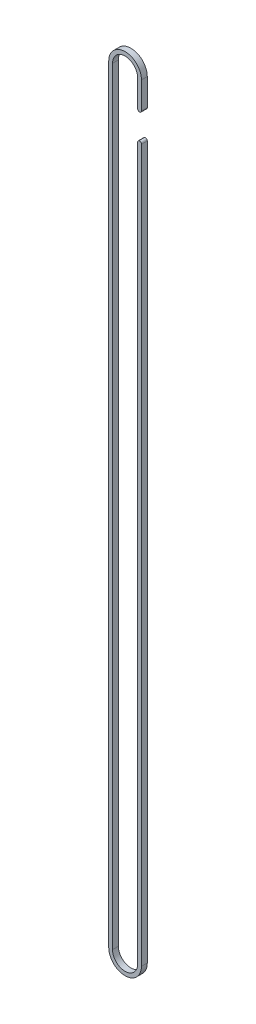
ISO-10303-21;
HEADER;
FILE_DESCRIPTION(('STEP AP214'),'2;1');
FILE_NAME('part.step','',(''),(''),'','','');
FILE_SCHEMA(('AUTOMOTIVE_DESIGN { 1 0 10303 214 1 1 1 1 }'));
ENDSEC;
DATA;
#1=APPLICATION_CONTEXT('core data for automotive mechanical design processes');
#2=APPLICATION_PROTOCOL_DEFINITION('international standard','automotive_design',2000,#1);
#3=PRODUCT_CONTEXT('',#1,'mechanical');
#4=PRODUCT('Part','Part','',(#3));
#5=PRODUCT_RELATED_PRODUCT_CATEGORY('part','',(#4));
#6=PRODUCT_DEFINITION_FORMATION('','',#4);
#7=PRODUCT_DEFINITION_CONTEXT('part definition',#1,'design');
#8=PRODUCT_DEFINITION('design','',#6,#7);
#9=PRODUCT_DEFINITION_SHAPE('','',#8);
#10=(LENGTH_UNIT() NAMED_UNIT(*) SI_UNIT(.MILLI.,.METRE.));
#11=(NAMED_UNIT(*) PLANE_ANGLE_UNIT() SI_UNIT($,.RADIAN.));
#12=(NAMED_UNIT(*) SI_UNIT($,.STERADIAN.) SOLID_ANGLE_UNIT());
#13=UNCERTAINTY_MEASURE_WITH_UNIT(LENGTH_MEASURE(1.E-05),#10,'distance_accuracy_value','');
#14=(GEOMETRIC_REPRESENTATION_CONTEXT(3) GLOBAL_UNCERTAINTY_ASSIGNED_CONTEXT((#13)) GLOBAL_UNIT_ASSIGNED_CONTEXT((#10,
#11,#12)) REPRESENTATION_CONTEXT('',''));
#15=CARTESIAN_POINT('',(0.,0.,0.));
#16=DIRECTION('',(0.,0.,1.));
#17=DIRECTION('',(1.,0.,0.));
#18=AXIS2_PLACEMENT_3D('',#15,#16,#17);
#19=CARTESIAN_POINT('',(22.233945549938,504.825,-4.5));
#20=DIRECTION('',(0.,0.,1.));
#21=DIRECTION('',(1.,0.,0.));
#22=AXIS2_PLACEMENT_3D('',#19,#20,#21);
#23=CYLINDRICAL_SURFACE('',#22,2.9464);
#24=CARTESIAN_POINT('',(22.233945549938,504.825,4.5));
#25=DIRECTION('',(0.,0.,-1.));
#26=DIRECTION('',(-1.,0.,0.));
#27=AXIS2_PLACEMENT_3D('',#24,#25,#26);
#28=CIRCLE('',#27,2.9464);
#29=CARTESIAN_POINT('',(19.287545549938,504.825,4.5));
#30=VERTEX_POINT('',#29);
#31=CARTESIAN_POINT('',(25.180345549938,504.825,4.5));
#32=VERTEX_POINT('',#31);
#33=EDGE_CURVE('E74',#30,#32,#28,.T.);
#34=ORIENTED_EDGE('',*,*,#33,.T.);
#35=DIRECTION('',(0.,0.,1.));
#36=VECTOR('',#35,1.);
#37=CARTESIAN_POINT('',(25.180345549938,504.825,-4.5));
#38=LINE('',#37,#36);
#39=CARTESIAN_POINT('',(25.180345549938,504.825,-4.5));
#40=VERTEX_POINT('',#39);
#41=EDGE_CURVE('E285',#40,#32,#38,.T.);
#42=ORIENTED_EDGE('',*,*,#41,.F.);
#43=CARTESIAN_POINT('',(22.233945549938,504.825,-4.5));
#44=DIRECTION('',(0.,0.,-1.));
#45=DIRECTION('',(-1.,0.,0.));
#46=AXIS2_PLACEMENT_3D('',#43,#44,#45);
#47=CIRCLE('',#46,2.9464);
#48=CARTESIAN_POINT('',(19.2875455499376,504.825,-4.5));
#49=VERTEX_POINT('',#48);
#50=EDGE_CURVE('E60',#49,#40,#47,.T.);
#51=ORIENTED_EDGE('',*,*,#50,.F.);
#52=DIRECTION('',(0.,0.,1.));
#53=VECTOR('',#52,1.);
#54=CARTESIAN_POINT('',(19.287545549938,504.825,-4.5));
#55=LINE('',#54,#53);
#56=EDGE_CURVE('E213',#49,#30,#55,.T.);
#57=ORIENTED_EDGE('',*,*,#56,.T.);
#58=EDGE_LOOP('',(#34,#42,#51,#57));
#59=FACE_BOUND('',#58,.T.);
#60=ADVANCED_FACE('F16',(#59),#23,.T.);
#61=CARTESIAN_POINT('',(22.233945549938,549.275,-4.5));
#62=DIRECTION('',(0.,0.,1.));
#63=DIRECTION('',(1.,0.,0.));
#64=AXIS2_PLACEMENT_3D('',#61,#62,#63);
#65=CYLINDRICAL_SURFACE('',#64,2.9464);
#66=CARTESIAN_POINT('',(22.233945549938,549.275,4.5));
#67=DIRECTION('',(0.,0.,-1.));
#68=DIRECTION('',(1.,0.,0.));
#69=AXIS2_PLACEMENT_3D('',#66,#67,#68);
#70=CIRCLE('',#69,2.9464);
#71=CARTESIAN_POINT('',(25.180345549938,549.275,4.5));
#72=VERTEX_POINT('',#71);
#73=CARTESIAN_POINT('',(19.2875455499376,549.275,4.5));
#74=VERTEX_POINT('',#73);
#75=EDGE_CURVE('E189',#72,#74,#70,.T.);
#76=ORIENTED_EDGE('',*,*,#75,.T.);
#77=DIRECTION('',(0.,0.,1.));
#78=VECTOR('',#77,1.);
#79=CARTESIAN_POINT('',(19.287545549938,549.275,-4.5));
#80=LINE('',#79,#78);
#81=CARTESIAN_POINT('',(19.287545549938,549.275,-4.5));
#82=VERTEX_POINT('',#81);
#83=EDGE_CURVE('E193',#82,#74,#80,.T.);
#84=ORIENTED_EDGE('',*,*,#83,.F.);
#85=CARTESIAN_POINT('',(22.233945549938,549.275,-4.5));
#86=DIRECTION('',(0.,0.,-1.));
#87=DIRECTION('',(1.,0.,0.));
#88=AXIS2_PLACEMENT_3D('',#85,#86,#87);
#89=CIRCLE('',#88,2.9464);
#90=CARTESIAN_POINT('',(25.180345549938,549.275,-4.5));
#91=VERTEX_POINT('',#90);
#92=EDGE_CURVE('E200',#91,#82,#89,.T.);
#93=ORIENTED_EDGE('',*,*,#92,.F.);
#94=DIRECTION('',(0.,0.,1.));
#95=VECTOR('',#94,1.);
#96=CARTESIAN_POINT('',(25.180345549938,549.275,-4.5));
#97=LINE('',#96,#95);
#98=EDGE_CURVE('E261',#91,#72,#97,.T.);
#99=ORIENTED_EDGE('',*,*,#98,.T.);
#100=EDGE_LOOP('',(#76,#84,#93,#99));
#101=FACE_BOUND('',#100,.T.);
#102=ADVANCED_FACE('F18',(#101),#65,.T.);
#103=CARTESIAN_POINT('',(-19.287545549938,-590.55,4.5));
#104=DIRECTION('',(1.,0.,0.));
#105=DIRECTION('',(0.,1.,0.));
#106=AXIS2_PLACEMENT_3D('',#103,#104,#105);
#107=PLANE('',#106);
#108=DIRECTION('',(0.,-1.,0.));
#109=VECTOR('',#108,1.);
#110=CARTESIAN_POINT('',(-19.287545549938,-590.55,-4.5));
#111=LINE('',#110,#109);
#112=CARTESIAN_POINT('',(-19.287545549938,590.55,-4.5));
#113=VERTEX_POINT('',#112);
#114=CARTESIAN_POINT('',(-19.287545549938,-590.55,-4.5));
#115=VERTEX_POINT('',#114);
#116=EDGE_CURVE('E237',#113,#115,#111,.T.);
#117=ORIENTED_EDGE('',*,*,#116,.F.);
#118=DIRECTION('',(0.,0.,-1.));
#119=VECTOR('',#118,1.);
#120=CARTESIAN_POINT('',(-19.287545549938,590.55,4.5));
#121=LINE('',#120,#119);
#122=CARTESIAN_POINT('',(-19.287545549938,590.55,4.5));
#123=VERTEX_POINT('',#122);
#124=EDGE_CURVE('E11',#123,#113,#121,.T.);
#125=ORIENTED_EDGE('',*,*,#124,.F.);
#126=DIRECTION('',(0.,-1.,0.));
#127=VECTOR('',#126,1.);
#128=CARTESIAN_POINT('',(-19.287545549938,-590.55,4.5));
#129=LINE('',#128,#127);
#130=CARTESIAN_POINT('',(-19.287545549938,-590.55,4.5));
#131=VERTEX_POINT('',#130);
#132=EDGE_CURVE('E262',#123,#131,#129,.T.);
#133=ORIENTED_EDGE('',*,*,#132,.T.);
#134=DIRECTION('',(0.,0.,-1.));
#135=VECTOR('',#134,1.);
#136=CARTESIAN_POINT('',(-19.287545549938,-590.55,4.5));
#137=LINE('',#136,#135);
#138=EDGE_CURVE('E42',#131,#115,#137,.T.);
#139=ORIENTED_EDGE('',*,*,#138,.T.);
#140=EDGE_LOOP('',(#117,#125,#133,#139));
#141=FACE_BOUND('',#140,.T.);
#142=ADVANCED_FACE('F500',(#141),#107,.T.);
#143=CARTESIAN_POINT('',(-2.16964550170941E-13,590.55,4.5));
#144=DIRECTION('',(0.,0.,-1.));
#145=DIRECTION('',(-1.,0.,0.));
#146=AXIS2_PLACEMENT_3D('',#143,#144,#145);
#147=CYLINDRICAL_SURFACE('',#146,19.2875455499378);
#148=CARTESIAN_POINT('',(-2.16964550170941E-13,590.55,-4.5));
#149=DIRECTION('',(0.,0.,1.));
#150=DIRECTION('',(1.,0.,0.));
#151=AXIS2_PLACEMENT_3D('',#148,#149,#150);
#152=CIRCLE('',#151,19.2875455499378);
#153=CARTESIAN_POINT('',(19.2875455499376,590.55,-4.5));
#154=VERTEX_POINT('',#153);
#155=EDGE_CURVE('E208',#154,#113,#152,.T.);
#156=ORIENTED_EDGE('',*,*,#155,.F.);
#157=DIRECTION('',(0.,0.,-1.));
#158=VECTOR('',#157,1.);
#159=CARTESIAN_POINT('',(19.2875455499376,590.55,4.5));
#160=LINE('',#159,#158);
#161=CARTESIAN_POINT('',(19.2875455499376,590.55,4.5));
#162=VERTEX_POINT('',#161);
#163=EDGE_CURVE('E27',#162,#154,#160,.T.);
#164=ORIENTED_EDGE('',*,*,#163,.F.);
#165=CARTESIAN_POINT('',(-2.16964550170941E-13,590.55,4.5));
#166=DIRECTION('',(0.,0.,1.));
#167=DIRECTION('',(1.,0.,0.));
#168=AXIS2_PLACEMENT_3D('',#165,#166,#167);
#169=CIRCLE('',#168,19.2875455499378);
#170=EDGE_CURVE('E218',#162,#123,#169,.T.);
#171=ORIENTED_EDGE('',*,*,#170,.T.);
#172=ORIENTED_EDGE('',*,*,#124,.T.);
#173=EDGE_LOOP('',(#156,#164,#171,#172));
#174=FACE_BOUND('',#173,.T.);
#175=ADVANCED_FACE('F234',(#174),#147,.F.);
#176=CARTESIAN_POINT('',(19.287545549938,-590.55,4.5));
#177=DIRECTION('',(-1.,0.,0.));
#178=DIRECTION('',(0.,1.,0.));
#179=AXIS2_PLACEMENT_3D('',#176,#177,#178);
#180=PLANE('',#179);
#181=ORIENTED_EDGE('',*,*,#83,.T.);
#182=DIRECTION('',(0.,1.,0.));
#183=VECTOR('',#182,1.);
#184=CARTESIAN_POINT('',(19.287545549938,-590.55,4.5));
#185=LINE('',#184,#183);
#186=EDGE_CURVE('E215',#74,#162,#185,.T.);
#187=ORIENTED_EDGE('',*,*,#186,.T.);
#188=ORIENTED_EDGE('',*,*,#163,.T.);
#189=DIRECTION('',(0.,1.,0.));
#190=VECTOR('',#189,1.);
#191=CARTESIAN_POINT('',(19.287545549938,-590.55,-4.5));
#192=LINE('',#191,#190);
#193=EDGE_CURVE('E204',#82,#154,#192,.T.);
#194=ORIENTED_EDGE('',*,*,#193,.F.);
#195=EDGE_LOOP('',(#181,#187,#188,#194));
#196=FACE_BOUND('',#195,.T.);
#197=ADVANCED_FACE('F227',(#196),#180,.T.);
#198=CARTESIAN_POINT('',(0.,-590.55,4.5));
#199=DIRECTION('',(0.,0.,-1.));
#200=DIRECTION('',(-1.,0.,0.));
#201=AXIS2_PLACEMENT_3D('',#198,#199,#200);
#202=CYLINDRICAL_SURFACE('',#201,19.287545549938);
#203=CARTESIAN_POINT('',(0.,-590.55,-4.5));
#204=DIRECTION('',(0.,0.,1.));
#205=DIRECTION('',(1.,0.,0.));
#206=AXIS2_PLACEMENT_3D('',#203,#204,#205);
#207=CIRCLE('',#206,19.287545549938);
#208=CARTESIAN_POINT('',(19.287545549938,-590.55,-4.5));
#209=VERTEX_POINT('',#208);
#210=EDGE_CURVE('E258',#115,#209,#207,.T.);
#211=ORIENTED_EDGE('',*,*,#210,.F.);
#212=ORIENTED_EDGE('',*,*,#138,.F.);
#213=CARTESIAN_POINT('',(0.,-590.55,4.5));
#214=DIRECTION('',(0.,0.,1.));
#215=DIRECTION('',(1.,0.,0.));
#216=AXIS2_PLACEMENT_3D('',#213,#214,#215);
#217=CIRCLE('',#216,19.287545549938);
#218=CARTESIAN_POINT('',(19.287545549938,-590.55,4.5));
#219=VERTEX_POINT('',#218);
#220=EDGE_CURVE('E103',#131,#219,#217,.T.);
#221=ORIENTED_EDGE('',*,*,#220,.T.);
#222=DIRECTION('',(0.,0.,-1.));
#223=VECTOR('',#222,1.);
#224=CARTESIAN_POINT('',(19.287545549938,-590.55,4.5));
#225=LINE('',#224,#223);
#226=EDGE_CURVE('E202',#219,#209,#225,.T.);
#227=ORIENTED_EDGE('',*,*,#226,.T.);
#228=EDGE_LOOP('',(#211,#212,#221,#227));
#229=FACE_BOUND('',#228,.T.);
#230=ADVANCED_FACE('F504',(#229),#202,.F.);
#231=CARTESIAN_POINT('',(-25.180345549938,-590.55,4.5));
#232=DIRECTION('',(1.,0.,0.));
#233=DIRECTION('',(0.,1.,0.));
#234=AXIS2_PLACEMENT_3D('',#231,#232,#233);
#235=PLANE('',#234);
#236=DIRECTION('',(0.,-1.,0.));
#237=VECTOR('',#236,1.);
#238=CARTESIAN_POINT('',(-25.180345549938,-590.55,-4.5));
#239=LINE('',#238,#237);
#240=CARTESIAN_POINT('',(-25.180345549938,590.55,-4.5));
#241=VERTEX_POINT('',#240);
#242=CARTESIAN_POINT('',(-25.180345549938,-590.55,-4.5));
#243=VERTEX_POINT('',#242);
#244=EDGE_CURVE('E254',#241,#243,#239,.T.);
#245=ORIENTED_EDGE('',*,*,#244,.T.);
#246=DIRECTION('',(0.,0.,-1.));
#247=VECTOR('',#246,1.);
#248=CARTESIAN_POINT('',(-25.180345549938,-590.55,4.5));
#249=LINE('',#248,#247);
#250=CARTESIAN_POINT('',(-25.180345549938,-590.55,4.5));
#251=VERTEX_POINT('',#250);
#252=EDGE_CURVE('E174',#251,#243,#249,.T.);
#253=ORIENTED_EDGE('',*,*,#252,.F.);
#254=DIRECTION('',(0.,-1.,0.));
#255=VECTOR('',#254,1.);
#256=CARTESIAN_POINT('',(-25.180345549938,-590.55,4.5));
#257=LINE('',#256,#255);
#258=CARTESIAN_POINT('',(-25.180345549938,590.55,4.5));
#259=VERTEX_POINT('',#258);
#260=EDGE_CURVE('E172',#259,#251,#257,.T.);
#261=ORIENTED_EDGE('',*,*,#260,.F.);
#262=DIRECTION('',(0.,0.,-1.));
#263=VECTOR('',#262,1.);
#264=CARTESIAN_POINT('',(-25.180345549938,590.55,4.5));
#265=LINE('',#264,#263);
#266=EDGE_CURVE('E157',#259,#241,#265,.T.);
#267=ORIENTED_EDGE('',*,*,#266,.T.);
#268=EDGE_LOOP('',(#245,#253,#261,#267));
#269=FACE_BOUND('',#268,.T.);
#270=ADVANCED_FACE('F173',(#269),#235,.F.);
#271=CARTESIAN_POINT('',(-2.16964550170941E-13,590.55,4.5));
#272=DIRECTION('',(0.,0.,-1.));
#273=DIRECTION('',(-1.,0.,0.));
#274=AXIS2_PLACEMENT_3D('',#271,#272,#273);
#275=CYLINDRICAL_SURFACE('',#274,25.1803455499377);
#276=CARTESIAN_POINT('',(-2.16964550170941E-13,590.55,-4.5));
#277=DIRECTION('',(0.,0.,1.));
#278=DIRECTION('',(1.,0.,0.));
#279=AXIS2_PLACEMENT_3D('',#276,#277,#278);
#280=CIRCLE('',#279,25.1803455499377);
#281=CARTESIAN_POINT('',(25.1803455499375,590.55,-4.5));
#282=VERTEX_POINT('',#281);
#283=EDGE_CURVE('E165',#282,#241,#280,.T.);
#284=ORIENTED_EDGE('',*,*,#283,.T.);
#285=ORIENTED_EDGE('',*,*,#266,.F.);
#286=CARTESIAN_POINT('',(-2.16964550170941E-13,590.55,4.5));
#287=DIRECTION('',(0.,0.,1.));
#288=DIRECTION('',(1.,0.,0.));
#289=AXIS2_PLACEMENT_3D('',#286,#287,#288);
#290=CIRCLE('',#289,25.1803455499377);
#291=CARTESIAN_POINT('',(25.1803455499375,590.55,4.5));
#292=VERTEX_POINT('',#291);
#293=EDGE_CURVE('E162',#292,#259,#290,.T.);
#294=ORIENTED_EDGE('',*,*,#293,.F.);
#295=DIRECTION('',(0.,0.,-1.));
#296=VECTOR('',#295,1.);
#297=CARTESIAN_POINT('',(25.1803455499375,590.55,4.5));
#298=LINE('',#297,#296);
#299=EDGE_CURVE('E20',#292,#282,#298,.T.);
#300=ORIENTED_EDGE('',*,*,#299,.T.);
#301=EDGE_LOOP('',(#284,#285,#294,#300));
#302=FACE_BOUND('',#301,.T.);
#303=ADVANCED_FACE('F159',(#302),#275,.T.);
#304=CARTESIAN_POINT('',(25.180345549938,-590.55,4.5));
#305=DIRECTION('',(-1.,0.,0.));
#306=DIRECTION('',(0.,1.,0.));
#307=AXIS2_PLACEMENT_3D('',#304,#305,#306);
#308=PLANE('',#307);
#309=DIRECTION('',(0.,1.,0.));
#310=VECTOR('',#309,1.);
#311=CARTESIAN_POINT('',(25.180345549938,-590.55,4.5));
#312=LINE('',#311,#310);
#313=EDGE_CURVE('E182',#72,#292,#312,.T.);
#314=ORIENTED_EDGE('',*,*,#313,.F.);
#315=ORIENTED_EDGE('',*,*,#98,.F.);
#316=DIRECTION('',(0.,1.,0.));
#317=VECTOR('',#316,1.);
#318=CARTESIAN_POINT('',(25.180345549938,-590.55,-4.5));
#319=LINE('',#318,#317);
#320=EDGE_CURVE('E196',#91,#282,#319,.T.);
#321=ORIENTED_EDGE('',*,*,#320,.T.);
#322=ORIENTED_EDGE('',*,*,#299,.F.);
#323=EDGE_LOOP('',(#314,#315,#321,#322));
#324=FACE_BOUND('',#323,.T.);
#325=ADVANCED_FACE('F483',(#324),#308,.F.);
#326=CARTESIAN_POINT('',(0.,-590.55,4.5));
#327=DIRECTION('',(0.,0.,-1.));
#328=DIRECTION('',(-1.,0.,0.));
#329=AXIS2_PLACEMENT_3D('',#326,#327,#328);
#330=CYLINDRICAL_SURFACE('',#329,25.180345549938);
#331=CARTESIAN_POINT('',(0.,-590.55,-4.5));
#332=DIRECTION('',(0.,0.,1.));
#333=DIRECTION('',(1.,0.,0.));
#334=AXIS2_PLACEMENT_3D('',#331,#332,#333);
#335=CIRCLE('',#334,25.180345549938);
#336=CARTESIAN_POINT('',(25.180345549938,-590.55,-4.5));
#337=VERTEX_POINT('',#336);
#338=EDGE_CURVE('E252',#243,#337,#335,.T.);
#339=ORIENTED_EDGE('',*,*,#338,.T.);
#340=DIRECTION('',(0.,0.,-1.));
#341=VECTOR('',#340,1.);
#342=CARTESIAN_POINT('',(25.180345549938,-590.55,4.5));
#343=LINE('',#342,#341);
#344=CARTESIAN_POINT('',(25.180345549938,-590.55,4.5));
#345=VERTEX_POINT('',#344);
#346=EDGE_CURVE('E248',#345,#337,#343,.T.);
#347=ORIENTED_EDGE('',*,*,#346,.F.);
#348=CARTESIAN_POINT('',(0.,-590.55,4.5));
#349=DIRECTION('',(0.,0.,1.));
#350=DIRECTION('',(1.,0.,0.));
#351=AXIS2_PLACEMENT_3D('',#348,#349,#350);
#352=CIRCLE('',#351,25.180345549938);
#353=EDGE_CURVE('E177',#251,#345,#352,.T.);
#354=ORIENTED_EDGE('',*,*,#353,.F.);
#355=ORIENTED_EDGE('',*,*,#252,.T.);
#356=EDGE_LOOP('',(#339,#347,#354,#355));
#357=FACE_BOUND('',#356,.T.);
#358=ADVANCED_FACE('F481',(#357),#330,.T.);
#359=CARTESIAN_POINT('',(0.,-590.55,-4.5));
#360=DIRECTION('',(0.,0.,1.));
#361=DIRECTION('',(1.,0.,0.));
#362=AXIS2_PLACEMENT_3D('',#359,#360,#361);
#363=PLANE('',#362);
#364=DIRECTION('',(0.,1.,0.));
#365=VECTOR('',#364,1.);
#366=CARTESIAN_POINT('',(19.287545549938,-590.55,-4.5));
#367=LINE('',#366,#365);
#368=EDGE_CURVE('E282',#209,#49,#367,.T.);
#369=ORIENTED_EDGE('',*,*,#368,.T.);
#370=ORIENTED_EDGE('',*,*,#50,.T.);
#371=DIRECTION('',(0.,1.,0.));
#372=VECTOR('',#371,1.);
#373=CARTESIAN_POINT('',(25.180345549938,-590.55,-4.5));
#374=LINE('',#373,#372);
#375=EDGE_CURVE('E214',#337,#40,#374,.T.);
#376=ORIENTED_EDGE('',*,*,#375,.F.);
#377=ORIENTED_EDGE('',*,*,#338,.F.);
#378=ORIENTED_EDGE('',*,*,#244,.F.);
#379=ORIENTED_EDGE('',*,*,#283,.F.);
#380=ORIENTED_EDGE('',*,*,#320,.F.);
#381=ORIENTED_EDGE('',*,*,#92,.T.);
#382=ORIENTED_EDGE('',*,*,#193,.T.);
#383=ORIENTED_EDGE('',*,*,#155,.T.);
#384=ORIENTED_EDGE('',*,*,#116,.T.);
#385=ORIENTED_EDGE('',*,*,#210,.T.);
#386=EDGE_LOOP('',(#369,#370,#376,#377,#378,#379,#380,#381,#382,#383,#384,#385));
#387=FACE_BOUND('',#386,.T.);
#388=ADVANCED_FACE('F238',(#387),#363,.F.);
#389=CARTESIAN_POINT('',(0.,-590.55,4.5));
#390=DIRECTION('',(0.,0.,1.));
#391=DIRECTION('',(1.,0.,0.));
#392=AXIS2_PLACEMENT_3D('',#389,#390,#391);
#393=PLANE('',#392);
#394=ORIENTED_EDGE('',*,*,#33,.F.);
#395=DIRECTION('',(0.,1.,0.));
#396=VECTOR('',#395,1.);
#397=CARTESIAN_POINT('',(19.287545549938,-590.55,4.5));
#398=LINE('',#397,#396);
#399=EDGE_CURVE('E209',#219,#30,#398,.T.);
#400=ORIENTED_EDGE('',*,*,#399,.F.);
#401=ORIENTED_EDGE('',*,*,#220,.F.);
#402=ORIENTED_EDGE('',*,*,#132,.F.);
#403=ORIENTED_EDGE('',*,*,#170,.F.);
#404=ORIENTED_EDGE('',*,*,#186,.F.);
#405=ORIENTED_EDGE('',*,*,#75,.F.);
#406=ORIENTED_EDGE('',*,*,#313,.T.);
#407=ORIENTED_EDGE('',*,*,#293,.T.);
#408=ORIENTED_EDGE('',*,*,#260,.T.);
#409=ORIENTED_EDGE('',*,*,#353,.T.);
#410=DIRECTION('',(0.,1.,0.));
#411=VECTOR('',#410,1.);
#412=CARTESIAN_POINT('',(25.180345549938,-590.55,4.5));
#413=LINE('',#412,#411);
#414=EDGE_CURVE('E288',#345,#32,#413,.T.);
#415=ORIENTED_EDGE('',*,*,#414,.T.);
#416=EDGE_LOOP('',(#394,#400,#401,#402,#403,#404,#405,#406,#407,#408,#409,#415));
#417=FACE_BOUND('',#416,.T.);
#418=ADVANCED_FACE('F179',(#417),#393,.T.);
#419=CARTESIAN_POINT('',(19.287545549938,-590.55,4.5));
#420=DIRECTION('',(-1.,0.,0.));
#421=DIRECTION('',(0.,1.,0.));
#422=AXIS2_PLACEMENT_3D('',#419,#420,#421);
#423=PLANE('',#422);
#424=ORIENTED_EDGE('',*,*,#399,.T.);
#425=ORIENTED_EDGE('',*,*,#56,.F.);
#426=ORIENTED_EDGE('',*,*,#368,.F.);
#427=ORIENTED_EDGE('',*,*,#226,.F.);
#428=EDGE_LOOP('',(#424,#425,#426,#427));
#429=FACE_BOUND('',#428,.T.);
#430=ADVANCED_FACE('F295',(#429),#423,.T.);
#431=CARTESIAN_POINT('',(25.180345549938,-590.55,4.5));
#432=DIRECTION('',(-1.,0.,0.));
#433=DIRECTION('',(0.,1.,0.));
#434=AXIS2_PLACEMENT_3D('',#431,#432,#433);
#435=PLANE('',#434);
#436=ORIENTED_EDGE('',*,*,#41,.T.);
#437=ORIENTED_EDGE('',*,*,#414,.F.);
#438=ORIENTED_EDGE('',*,*,#346,.T.);
#439=ORIENTED_EDGE('',*,*,#375,.T.);
#440=EDGE_LOOP('',(#436,#437,#438,#439));
#441=FACE_BOUND('',#440,.T.);
#442=ADVANCED_FACE('F479',(#441),#435,.F.);
#443=CLOSED_SHELL('',(#60,#102,#142,#175,#197,#230,#270,#303,#325,#358,#388,#418,#430,#442));
#444=MANIFOLD_SOLID_BREP('B1',#443);
#445=ADVANCED_BREP_SHAPE_REPRESENTATION('',(#18,#444),#14);
#446=SHAPE_DEFINITION_REPRESENTATION(#9,#445);
ENDSEC;
END-ISO-10303-21;
